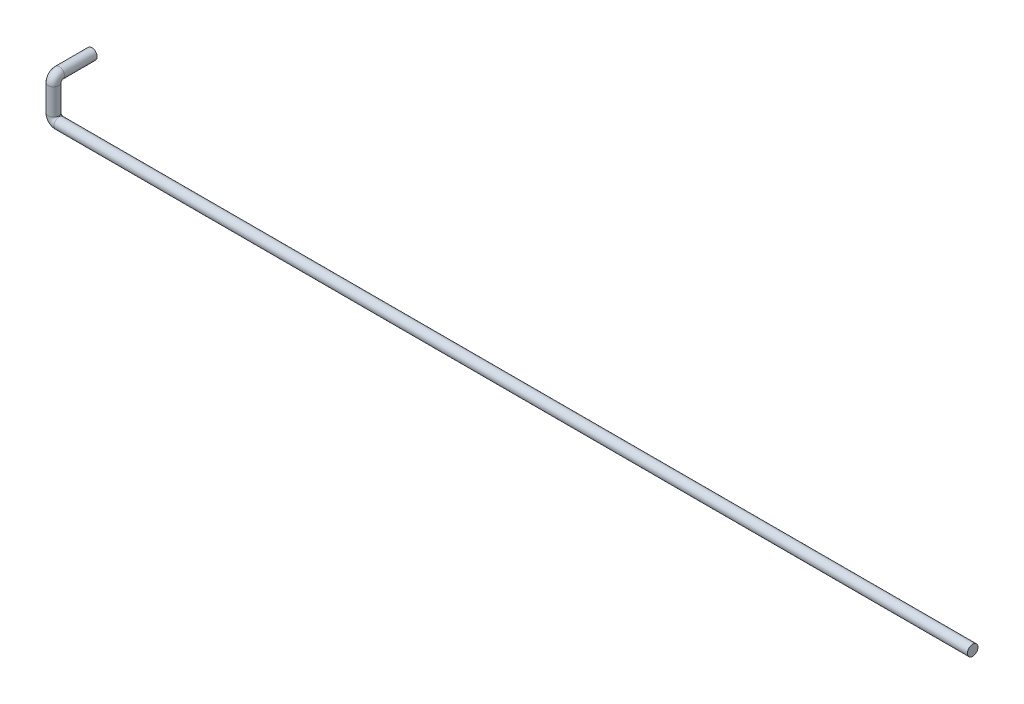
ISO-10303-21;
HEADER;
FILE_DESCRIPTION(('STEP AP214'),'2;1');
FILE_NAME('part.step','',(''),(''),'','','');
FILE_SCHEMA(('AUTOMOTIVE_DESIGN { 1 0 10303 214 1 1 1 1 }'));
ENDSEC;
DATA;
#1=APPLICATION_CONTEXT('core data for automotive mechanical design processes');
#2=APPLICATION_PROTOCOL_DEFINITION('international standard','automotive_design',2000,#1);
#3=PRODUCT_CONTEXT('',#1,'mechanical');
#4=PRODUCT('Part','Part','',(#3));
#5=PRODUCT_RELATED_PRODUCT_CATEGORY('part','',(#4));
#6=PRODUCT_DEFINITION_FORMATION('','',#4);
#7=PRODUCT_DEFINITION_CONTEXT('part definition',#1,'design');
#8=PRODUCT_DEFINITION('design','',#6,#7);
#9=PRODUCT_DEFINITION_SHAPE('','',#8);
#10=(LENGTH_UNIT() NAMED_UNIT(*) SI_UNIT(.MILLI.,.METRE.));
#11=(NAMED_UNIT(*) PLANE_ANGLE_UNIT() SI_UNIT($,.RADIAN.));
#12=(NAMED_UNIT(*) SI_UNIT($,.STERADIAN.) SOLID_ANGLE_UNIT());
#13=UNCERTAINTY_MEASURE_WITH_UNIT(LENGTH_MEASURE(1.E-05),#10,'distance_accuracy_value','');
#14=(GEOMETRIC_REPRESENTATION_CONTEXT(3) GLOBAL_UNCERTAINTY_ASSIGNED_CONTEXT((#13)) GLOBAL_UNIT_ASSIGNED_CONTEXT((#10,
#11,#12)) REPRESENTATION_CONTEXT('',''));
#15=CARTESIAN_POINT('',(0.,0.,0.));
#16=DIRECTION('',(0.,0.,1.));
#17=DIRECTION('',(1.,0.,0.));
#18=AXIS2_PLACEMENT_3D('',#15,#16,#17);
#19=CARTESIAN_POINT('',(0.,0.,0.));
#20=DIRECTION('',(1.,0.,0.));
#21=DIRECTION('',(0.,0.,-1.));
#22=AXIS2_PLACEMENT_3D('',#19,#20,#21);
#23=PLANE('',#22);
#24=CARTESIAN_POINT('',(0.,0.,0.));
#25=DIRECTION('',(1.,0.,0.));
#26=DIRECTION('',(0.,0.,-1.));
#27=AXIS2_PLACEMENT_3D('',#24,#25,#26);
#28=CIRCLE('',#27,13.7);
#29=CARTESIAN_POINT('',(0.,0.,-13.7));
#30=VERTEX_POINT('',#29);
#31=EDGE_CURVE('E49',#30,#30,#28,.T.);
#32=ORIENTED_EDGE('',*,*,#31,.T.);
#33=EDGE_LOOP('',(#32));
#34=FACE_BOUND('',#33,.T.);
#35=ADVANCED_FACE('F37',(#34),#23,.T.);
#36=CARTESIAN_POINT('',(-2389.,98.,-100.));
#37=DIRECTION('',(0.,0.,1.));
#38=DIRECTION('',(0.,-1.,0.));
#39=AXIS2_PLACEMENT_3D('',#36,#37,#38);
#40=PLANE('',#39);
#41=CARTESIAN_POINT('',(-2389.,98.,-100.));
#42=DIRECTION('',(0.,0.,1.));
#43=DIRECTION('',(0.,-1.,0.));
#44=AXIS2_PLACEMENT_3D('',#41,#42,#43);
#45=CIRCLE('',#44,13.7);
#46=CARTESIAN_POINT('',(-2389.,84.3,-100.));
#47=VERTEX_POINT('',#46);
#48=EDGE_CURVE('E11',#47,#47,#45,.T.);
#49=ORIENTED_EDGE('',*,*,#48,.F.);
#50=EDGE_LOOP('',(#49));
#51=FACE_BOUND('',#50,.T.);
#52=ADVANCED_FACE('F55',(#51),#40,.F.);
#53=CARTESIAN_POINT('',(0.,0.,0.));
#54=DIRECTION('',(-1.,0.,0.));
#55=DIRECTION('',(0.,0.,1.));
#56=AXIS2_PLACEMENT_3D('',#53,#54,#55);
#57=CYLINDRICAL_SURFACE('',#56,13.7);
#58=CARTESIAN_POINT('',(-2374.,0.,0.));
#59=DIRECTION('',(1.,0.,0.));
#60=DIRECTION('',(0.,0.,-1.));
#61=AXIS2_PLACEMENT_3D('',#58,#59,#60);
#62=CIRCLE('',#61,13.7);
#63=CARTESIAN_POINT('',(-2374.,-13.7000000000001,0.));
#64=VERTEX_POINT('',#63);
#65=EDGE_CURVE('E89',#64,#64,#62,.T.);
#66=ORIENTED_EDGE('',*,*,#65,.T.);
#67=EDGE_LOOP('',(#66));
#68=FACE_BOUND('',#67,.T.);
#69=ORIENTED_EDGE('',*,*,#31,.F.);
#70=EDGE_LOOP('',(#69));
#71=FACE_BOUND('',#70,.T.);
#72=ADVANCED_FACE('F57',(#68,#71),#57,.T.);
#73=CARTESIAN_POINT('',(-2374.,15.,0.));
#74=DIRECTION('',(0.,0.,-1.));
#75=DIRECTION('',(-1.,0.,0.));
#76=AXIS2_PLACEMENT_3D('',#73,#74,#75);
#77=TOROIDAL_SURFACE('',#76,15.0000000000001,13.7);
#78=CARTESIAN_POINT('',(-2389.,15.,0.));
#79=DIRECTION('',(0.,-1.,0.));
#80=DIRECTION('',(0.,0.,-1.));
#81=AXIS2_PLACEMENT_3D('',#78,#79,#80);
#82=CIRCLE('',#81,13.7);
#83=CARTESIAN_POINT('',(-2402.7,15.,0.));
#84=VERTEX_POINT('',#83);
#85=EDGE_CURVE('E86',#84,#84,#82,.T.);
#86=CARTESIAN_POINT('',(-2374.,15.,0.));
#87=DIRECTION('',(0.,0.,-1.));
#88=DIRECTION('',(-1.,0.,0.));
#89=AXIS2_PLACEMENT_3D('',#86,#87,#88);
#90=CIRCLE('',#89,28.7000000000001);
#91=EDGE_CURVE('',#64,#84,#90,.T.);
#92=ORIENTED_EDGE('',*,*,#65,.F.);
#93=ORIENTED_EDGE('',*,*,#85,.T.);
#94=ORIENTED_EDGE('',*,*,#91,.T.);
#95=ORIENTED_EDGE('',*,*,#91,.F.);
#96=EDGE_LOOP('',(#92,#94,#93,#95));
#97=FACE_BOUND('',#96,.T.);
#98=ADVANCED_FACE('F62',(#97),#77,.T.);
#99=CARTESIAN_POINT('',(-2389.,15.,0.));
#100=DIRECTION('',(0.,1.,0.));
#101=DIRECTION('',(0.,0.,1.));
#102=AXIS2_PLACEMENT_3D('',#99,#100,#101);
#103=CYLINDRICAL_SURFACE('',#102,13.7);
#104=CARTESIAN_POINT('',(-2389.,83.,0.));
#105=DIRECTION('',(0.,-1.,0.));
#106=DIRECTION('',(0.,0.,-1.));
#107=AXIS2_PLACEMENT_3D('',#104,#105,#106);
#108=CIRCLE('',#107,13.7);
#109=CARTESIAN_POINT('',(-2389.,83.,13.7));
#110=VERTEX_POINT('',#109);
#111=EDGE_CURVE('E91',#110,#110,#108,.T.);
#112=ORIENTED_EDGE('',*,*,#111,.T.);
#113=EDGE_LOOP('',(#112));
#114=FACE_BOUND('',#113,.T.);
#115=ORIENTED_EDGE('',*,*,#85,.F.);
#116=EDGE_LOOP('',(#115));
#117=FACE_BOUND('',#116,.T.);
#118=ADVANCED_FACE('F72',(#114,#117),#103,.T.);
#119=CARTESIAN_POINT('',(-2389.,83.,-15.));
#120=DIRECTION('',(-1.,0.,0.));
#121=DIRECTION('',(0.,0.,1.));
#122=AXIS2_PLACEMENT_3D('',#119,#120,#121);
#123=TOROIDAL_SURFACE('',#122,15.,13.7);
#124=CARTESIAN_POINT('',(-2389.,98.,-15.));
#125=DIRECTION('',(0.,0.,1.));
#126=DIRECTION('',(0.,-1.,0.));
#127=AXIS2_PLACEMENT_3D('',#124,#125,#126);
#128=CIRCLE('',#127,13.7);
#129=CARTESIAN_POINT('',(-2389.,111.7,-15.));
#130=VERTEX_POINT('',#129);
#131=EDGE_CURVE('E44',#130,#130,#128,.T.);
#132=CARTESIAN_POINT('',(-2389.,83.,-15.));
#133=DIRECTION('',(-1.,0.,0.));
#134=DIRECTION('',(0.,0.,1.));
#135=AXIS2_PLACEMENT_3D('',#132,#133,#134);
#136=CIRCLE('',#135,28.7);
#137=EDGE_CURVE('',#110,#130,#136,.T.);
#138=ORIENTED_EDGE('',*,*,#111,.F.);
#139=ORIENTED_EDGE('',*,*,#131,.T.);
#140=ORIENTED_EDGE('',*,*,#137,.T.);
#141=ORIENTED_EDGE('',*,*,#137,.F.);
#142=EDGE_LOOP('',(#138,#140,#139,#141));
#143=FACE_BOUND('',#142,.T.);
#144=ADVANCED_FACE('F68',(#143),#123,.T.);
#145=CARTESIAN_POINT('',(-2389.,98.,-15.));
#146=DIRECTION('',(0.,0.,-1.));
#147=DIRECTION('',(-1.,0.,0.));
#148=AXIS2_PLACEMENT_3D('',#145,#146,#147);
#149=CYLINDRICAL_SURFACE('',#148,13.7);
#150=ORIENTED_EDGE('',*,*,#48,.T.);
#151=EDGE_LOOP('',(#150));
#152=FACE_BOUND('',#151,.T.);
#153=ORIENTED_EDGE('',*,*,#131,.F.);
#154=EDGE_LOOP('',(#153));
#155=FACE_BOUND('',#154,.T.);
#156=ADVANCED_FACE('F52',(#152,#155),#149,.T.);
#157=CLOSED_SHELL('',(#35,#52,#72,#98,#118,#144,#156));
#158=MANIFOLD_SOLID_BREP('B2',#157);
#159=ADVANCED_BREP_SHAPE_REPRESENTATION('',(#18,#158),#14);
#160=SHAPE_DEFINITION_REPRESENTATION(#9,#159);
ENDSEC;
END-ISO-10303-21;
